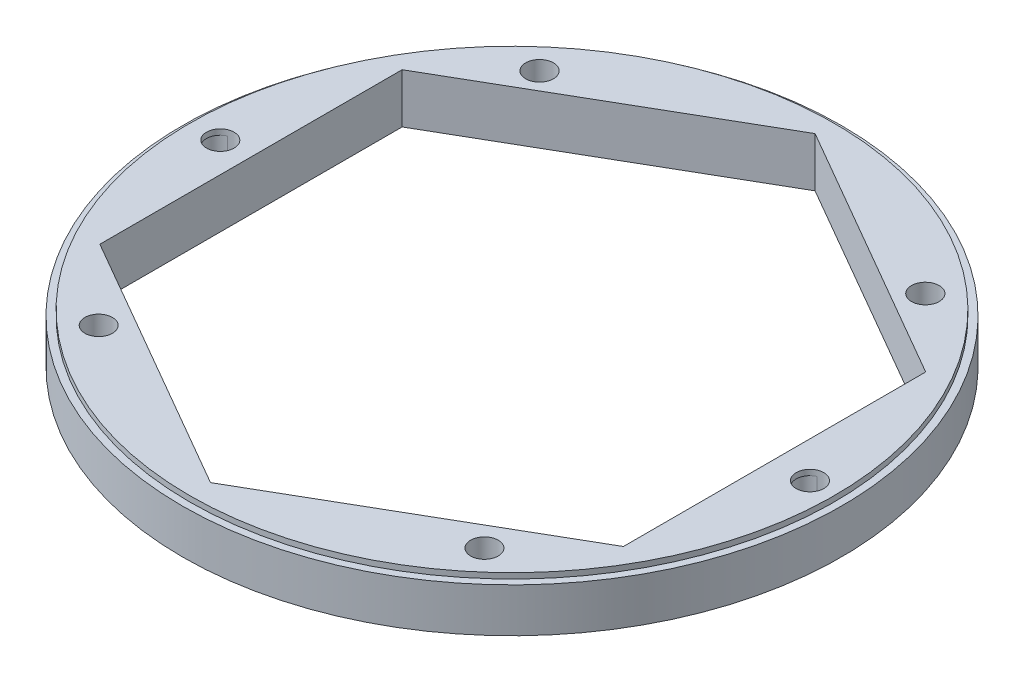
ISO-10303-21;
HEADER;
FILE_DESCRIPTION(('STEP AP214'),'2;1');
FILE_NAME('part.step','',(''),(''),'','','');
FILE_SCHEMA(('AUTOMOTIVE_DESIGN { 1 0 10303 214 1 1 1 1 }'));
ENDSEC;
DATA;
#1=APPLICATION_CONTEXT('core data for automotive mechanical design processes');
#2=APPLICATION_PROTOCOL_DEFINITION('international standard','automotive_design',2000,#1);
#3=PRODUCT_CONTEXT('',#1,'mechanical');
#4=PRODUCT('Part','Part','',(#3));
#5=PRODUCT_RELATED_PRODUCT_CATEGORY('part','',(#4));
#6=PRODUCT_DEFINITION_FORMATION('','',#4);
#7=PRODUCT_DEFINITION_CONTEXT('part definition',#1,'design');
#8=PRODUCT_DEFINITION('design','',#6,#7);
#9=PRODUCT_DEFINITION_SHAPE('','',#8);
#10=(LENGTH_UNIT() NAMED_UNIT(*) SI_UNIT(.MILLI.,.METRE.));
#11=(NAMED_UNIT(*) PLANE_ANGLE_UNIT() SI_UNIT($,.RADIAN.));
#12=(NAMED_UNIT(*) SI_UNIT($,.STERADIAN.) SOLID_ANGLE_UNIT());
#13=UNCERTAINTY_MEASURE_WITH_UNIT(LENGTH_MEASURE(1.E-05),#10,'distance_accuracy_value','');
#14=(GEOMETRIC_REPRESENTATION_CONTEXT(3) GLOBAL_UNCERTAINTY_ASSIGNED_CONTEXT((#13)) GLOBAL_UNIT_ASSIGNED_CONTEXT((#10,
#11,#12)) REPRESENTATION_CONTEXT('',''));
#15=CARTESIAN_POINT('',(0.,0.,0.));
#16=DIRECTION('',(0.,0.,1.));
#17=DIRECTION('',(1.,0.,0.));
#18=AXIS2_PLACEMENT_3D('',#15,#16,#17);
#19=CARTESIAN_POINT('',(0.,10.16,0.));
#20=DIRECTION('',(0.,-1.,0.));
#21=DIRECTION('',(0.,0.,-1.));
#22=AXIS2_PLACEMENT_3D('',#19,#20,#21);
#23=CYLINDRICAL_SURFACE('',#22,75.946);
#24=CARTESIAN_POINT('',(0.,10.16,0.));
#25=DIRECTION('',(0.,1.,0.));
#26=DIRECTION('',(0.,0.,1.));
#27=AXIS2_PLACEMENT_3D('',#24,#25,#26);
#28=CIRCLE('',#27,75.946);
#29=CARTESIAN_POINT('',(0.,10.16,75.946));
#30=VERTEX_POINT('',#29);
#31=EDGE_CURVE('E263',#30,#30,#28,.T.);
#32=ORIENTED_EDGE('',*,*,#31,.F.);
#33=EDGE_LOOP('',(#32));
#34=FACE_BOUND('',#33,.T.);
#35=CARTESIAN_POINT('',(0.,0.,0.));
#36=DIRECTION('',(0.,1.,0.));
#37=DIRECTION('',(0.,0.,1.));
#38=AXIS2_PLACEMENT_3D('',#35,#36,#37);
#39=CIRCLE('',#38,75.946);
#40=CARTESIAN_POINT('',(0.,0.,75.946));
#41=VERTEX_POINT('',#40);
#42=EDGE_CURVE('E330',#41,#41,#39,.T.);
#43=ORIENTED_EDGE('',*,*,#42,.T.);
#44=EDGE_LOOP('',(#43));
#45=FACE_BOUND('',#44,.T.);
#46=ADVANCED_FACE('F39',(#34,#45),#23,.T.);
#47=CARTESIAN_POINT('',(0.,10.16,0.));
#48=DIRECTION('',(0.,1.,0.));
#49=DIRECTION('',(0.,0.,1.));
#50=AXIS2_PLACEMENT_3D('',#47,#48,#49);
#51=PLANE('',#50);
#52=CARTESIAN_POINT('',(0.,10.16,0.));
#53=DIRECTION('',(0.,1.,0.));
#54=DIRECTION('',(0.,0.,1.));
#55=AXIS2_PLACEMENT_3D('',#52,#53,#54);
#56=CIRCLE('',#55,74.295);
#57=CARTESIAN_POINT('',(0.,10.16,74.295));
#58=VERTEX_POINT('',#57);
#59=EDGE_CURVE('E259',#58,#58,#56,.T.);
#60=ORIENTED_EDGE('',*,*,#59,.F.);
#61=EDGE_LOOP('',(#60));
#62=FACE_BOUND('',#61,.T.);
#63=ORIENTED_EDGE('',*,*,#31,.T.);
#64=EDGE_LOOP('',(#63));
#65=FACE_BOUND('',#64,.T.);
#66=ADVANCED_FACE('F410',(#62,#65),#51,.T.);
#67=CARTESIAN_POINT('',(0.,0.,0.));
#68=DIRECTION('',(0.,1.,0.));
#69=DIRECTION('',(0.,0.,1.));
#70=AXIS2_PLACEMENT_3D('',#67,#68,#69);
#71=PLANE('',#70);
#72=DIRECTION('',(-0.866025403784439,0.,-0.5));
#73=VECTOR('',#72,1.);
#74=CARTESIAN_POINT('',(60.325,0.,-34.8286549888642));
#75=LINE('',#74,#73);
#76=CARTESIAN_POINT('',(60.325,0.,-34.8286549888642));
#77=VERTEX_POINT('',#76);
#78=CARTESIAN_POINT('',(60.1441525682417,0.,-34.9330673022721));
#79=VERTEX_POINT('',#78);
#80=EDGE_CURVE('E300',#77,#79,#75,.T.);
#81=ORIENTED_EDGE('',*,*,#80,.T.);
#82=DIRECTION('',(0.,0.,-1.));
#83=VECTOR('',#82,1.);
#84=CARTESIAN_POINT('',(60.1441525682418,0.,34.4669601253477));
#85=LINE('',#84,#83);
#86=CARTESIAN_POINT('',(60.1441525682417,0.,-35.1903498523806));
#87=VERTEX_POINT('',#86);
#88=EDGE_CURVE('E159',#79,#87,#85,.T.);
#89=ORIENTED_EDGE('',*,*,#88,.T.);
#90=DIRECTION('',(-0.866025403784439,0.,-0.5));
#91=VECTOR('',#90,1.);
#92=CARTESIAN_POINT('',(60.1441525682417,0.,-35.1903498523806));
#93=LINE('',#92,#91);
#94=CARTESIAN_POINT('',(-0.180847431758238,0.,-70.0190048412448));
#95=VERTEX_POINT('',#94);
#96=EDGE_CURVE('E153',#87,#95,#93,.T.);
#97=ORIENTED_EDGE('',*,*,#96,.T.);
#98=DIRECTION('',(-0.866025403784439,0.,0.5));
#99=VECTOR('',#98,1.);
#100=CARTESIAN_POINT('',(-0.180847431758238,0.,-70.0190048412448));
#101=LINE('',#100,#99);
#102=CARTESIAN_POINT('',(-60.5058474317582,0.,-35.1903498523806));
#103=VERTEX_POINT('',#102);
#104=EDGE_CURVE('E162',#95,#103,#101,.T.);
#105=ORIENTED_EDGE('',*,*,#104,.T.);
#106=DIRECTION('',(0.,0.,1.));
#107=VECTOR('',#106,1.);
#108=CARTESIAN_POINT('',(-60.5058474317582,0.,-35.1903498523806));
#109=LINE('',#108,#107);
#110=CARTESIAN_POINT('',(-60.5058474317582,0.,34.4669601253478));
#111=VERTEX_POINT('',#110);
#112=EDGE_CURVE('E167',#103,#111,#109,.T.);
#113=ORIENTED_EDGE('',*,*,#112,.T.);
#114=DIRECTION('',(0.866025403784438,0.,0.5));
#115=VECTOR('',#114,1.);
#116=CARTESIAN_POINT('',(-60.5058474317582,0.,34.4669601253478));
#117=LINE('',#116,#115);
#118=CARTESIAN_POINT('',(-60.325,0.,34.5713724387556));
#119=VERTEX_POINT('',#118);
#120=EDGE_CURVE('E179',#111,#119,#117,.T.);
#121=ORIENTED_EDGE('',*,*,#120,.T.);
#122=DIRECTION('',(0.,0.,1.));
#123=VECTOR('',#122,1.);
#124=CARTESIAN_POINT('',(-60.325,0.,-34.8286549888642));
#125=LINE('',#124,#123);
#126=CARTESIAN_POINT('',(-60.325,0.,34.8286549888642));
#127=VERTEX_POINT('',#126);
#128=EDGE_CURVE('E302',#119,#127,#125,.T.);
#129=ORIENTED_EDGE('',*,*,#128,.T.);
#130=DIRECTION('',(0.866025403784439,0.,0.5));
#131=VECTOR('',#130,1.);
#132=CARTESIAN_POINT('',(-60.325,0.,34.8286549888642));
#133=LINE('',#132,#131);
#134=CARTESIAN_POINT('',(0.,0.,69.6573099777283));
#135=VERTEX_POINT('',#134);
#136=EDGE_CURVE('E305',#127,#135,#133,.T.);
#137=ORIENTED_EDGE('',*,*,#136,.T.);
#138=DIRECTION('',(0.866025403784439,0.,-0.5));
#139=VECTOR('',#138,1.);
#140=CARTESIAN_POINT('',(0.,0.,69.6573099777283));
#141=LINE('',#140,#139);
#142=CARTESIAN_POINT('',(60.325,0.,34.8286549888642));
#143=VERTEX_POINT('',#142);
#144=EDGE_CURVE('E308',#135,#143,#141,.T.);
#145=ORIENTED_EDGE('',*,*,#144,.T.);
#146=DIRECTION('',(0.,0.,-1.));
#147=VECTOR('',#146,1.);
#148=CARTESIAN_POINT('',(60.325,0.,34.8286549888642));
#149=LINE('',#148,#147);
#150=EDGE_CURVE('E311',#143,#77,#149,.T.);
#151=ORIENTED_EDGE('',*,*,#150,.T.);
#152=EDGE_LOOP('',(#81,#89,#97,#105,#113,#121,#129,#137,#145,#151));
#153=FACE_BOUND('',#152,.T.);
#154=CARTESIAN_POINT('',(44.45,0.,-50.8));
#155=DIRECTION('',(0.,1.,0.));
#156=DIRECTION('',(0.,0.,-1.));
#157=AXIS2_PLACEMENT_3D('',#154,#155,#156);
#158=CIRCLE('',#157,3.2);
#159=CARTESIAN_POINT('',(44.45,0.,-54.));
#160=VERTEX_POINT('',#159);
#161=EDGE_CURVE('E207',#160,#160,#158,.T.);
#162=ORIENTED_EDGE('',*,*,#161,.T.);
#163=EDGE_LOOP('',(#162));
#164=FACE_BOUND('',#163,.T.);
#165=CARTESIAN_POINT('',(44.45,0.,50.8));
#166=DIRECTION('',(0.,1.,0.));
#167=DIRECTION('',(0.,0.,-1.));
#168=AXIS2_PLACEMENT_3D('',#165,#166,#167);
#169=CIRCLE('',#168,3.175);
#170=CARTESIAN_POINT('',(44.45,0.,47.625));
#171=VERTEX_POINT('',#170);
#172=EDGE_CURVE('E236',#171,#171,#169,.T.);
#173=ORIENTED_EDGE('',*,*,#172,.T.);
#174=EDGE_LOOP('',(#173));
#175=FACE_BOUND('',#174,.T.);
#176=CARTESIAN_POINT('',(-44.45,0.,50.8));
#177=DIRECTION('',(0.,1.,0.));
#178=DIRECTION('',(0.,0.,1.));
#179=AXIS2_PLACEMENT_3D('',#176,#177,#178);
#180=CIRCLE('',#179,3.175);
#181=CARTESIAN_POINT('',(-44.45,0.,53.975));
#182=VERTEX_POINT('',#181);
#183=EDGE_CURVE('E230',#182,#182,#180,.T.);
#184=ORIENTED_EDGE('',*,*,#183,.T.);
#185=EDGE_LOOP('',(#184));
#186=FACE_BOUND('',#185,.T.);
#187=CARTESIAN_POINT('',(-44.45,0.,-50.8));
#188=DIRECTION('',(0.,1.,0.));
#189=DIRECTION('',(0.,0.,1.));
#190=AXIS2_PLACEMENT_3D('',#187,#188,#189);
#191=CIRCLE('',#190,3.2);
#192=CARTESIAN_POINT('',(-44.45,0.,-47.6));
#193=VERTEX_POINT('',#192);
#194=EDGE_CURVE('E224',#193,#193,#191,.T.);
#195=ORIENTED_EDGE('',*,*,#194,.T.);
#196=EDGE_LOOP('',(#195));
#197=FACE_BOUND('',#196,.T.);
#198=CARTESIAN_POINT('',(-67.945,0.,0.));
#199=DIRECTION('',(0.,1.,0.));
#200=DIRECTION('',(0.,0.,1.));
#201=AXIS2_PLACEMENT_3D('',#198,#199,#200);
#202=CIRCLE('',#201,3.18347823414576);
#203=CARTESIAN_POINT('',(-68.6763638399502,0.,-3.09832867864162));
#204=VERTEX_POINT('',#203);
#205=CARTESIAN_POINT('',(-66.6710938647752,0.,2.91748124688341));
#206=VERTEX_POINT('',#205);
#207=EDGE_CURVE('E264',#204,#206,#202,.T.);
#208=ORIENTED_EDGE('',*,*,#207,.T.);
#209=CARTESIAN_POINT('',(-67.4024577047254,0.,-0.18084743175821));
#210=DIRECTION('',(0.,1.,0.));
#211=DIRECTION('',(0.,0.,1.));
#212=AXIS2_PLACEMENT_3D('',#209,#210,#211);
#213=CIRCLE('',#212,3.18347823414576);
#214=EDGE_CURVE('E208',#206,#204,#213,.T.);
#215=ORIENTED_EDGE('',*,*,#214,.T.);
#216=EDGE_LOOP('',(#208,#215));
#217=FACE_BOUND('',#216,.T.);
#218=CARTESIAN_POINT('',(33.7795726028679,0.,-58.8088547950906));
#219=DIRECTION('',(0.,1.,0.));
#220=DIRECTION('',(0.,0.,-1.));
#221=AXIS2_PLACEMENT_3D('',#218,#219,#220);
#222=CIRCLE('',#221,3.2);
#223=CARTESIAN_POINT('',(33.7795726028679,0.,-62.0088547950906));
#224=VERTEX_POINT('',#223);
#225=EDGE_CURVE('E269',#224,#224,#222,.T.);
#226=ORIENTED_EDGE('',*,*,#225,.T.);
#227=EDGE_LOOP('',(#226));
#228=FACE_BOUND('',#227,.T.);
#229=CARTESIAN_POINT('',(67.945,0.,0.));
#230=DIRECTION('',(0.,1.,0.));
#231=DIRECTION('',(0.,0.,-1.));
#232=AXIS2_PLACEMENT_3D('',#229,#230,#231);
#233=CIRCLE('',#232,3.18347823414576);
#234=CARTESIAN_POINT('',(67.2136361600498,0.,-3.09832867864162));
#235=VERTEX_POINT('',#234);
#236=CARTESIAN_POINT('',(69.2189061352248,0.,2.91748124688341));
#237=VERTEX_POINT('',#236);
#238=EDGE_CURVE('E272',#235,#237,#233,.T.);
#239=ORIENTED_EDGE('',*,*,#238,.T.);
#240=CARTESIAN_POINT('',(68.4875422952747,0.,-0.18084743175821));
#241=DIRECTION('',(0.,1.,0.));
#242=DIRECTION('',(0.,0.,-1.));
#243=AXIS2_PLACEMENT_3D('',#240,#241,#242);
#244=CIRCLE('',#243,3.18347823414576);
#245=EDGE_CURVE('E219',#237,#235,#244,.T.);
#246=ORIENTED_EDGE('',*,*,#245,.T.);
#247=EDGE_LOOP('',(#239,#246));
#248=FACE_BOUND('',#247,.T.);
#249=CARTESIAN_POINT('',(33.9533081466792,0.,58.8088547950906));
#250=DIRECTION('',(0.,1.,0.));
#251=DIRECTION('',(0.,0.,-1.));
#252=AXIS2_PLACEMENT_3D('',#249,#250,#251);
#253=CIRCLE('',#252,3.175);
#254=CARTESIAN_POINT('',(33.9533081466792,0.,55.6338547950906));
#255=VERTEX_POINT('',#254);
#256=EDGE_CURVE('E279',#255,#255,#253,.T.);
#257=ORIENTED_EDGE('',*,*,#256,.T.);
#258=EDGE_LOOP('',(#257));
#259=FACE_BOUND('',#258,.T.);
#260=CARTESIAN_POINT('',(-33.9533081466792,0.,58.8088547950906));
#261=DIRECTION('',(0.,1.,0.));
#262=DIRECTION('',(0.,0.,1.));
#263=AXIS2_PLACEMENT_3D('',#260,#261,#262);
#264=CIRCLE('',#263,3.175);
#265=CARTESIAN_POINT('',(-33.9533081466792,0.,61.9838547950906));
#266=VERTEX_POINT('',#265);
#267=EDGE_CURVE('E276',#266,#266,#264,.T.);
#268=ORIENTED_EDGE('',*,*,#267,.T.);
#269=EDGE_LOOP('',(#268));
#270=FACE_BOUND('',#269,.T.);
#271=CARTESIAN_POINT('',(-33.7795726028679,0.,-58.8088547950906));
#272=DIRECTION('',(0.,1.,0.));
#273=DIRECTION('',(0.,0.,1.));
#274=AXIS2_PLACEMENT_3D('',#271,#272,#273);
#275=CIRCLE('',#274,3.2);
#276=CARTESIAN_POINT('',(-33.7795726028679,0.,-55.6088547950906));
#277=VERTEX_POINT('',#276);
#278=EDGE_CURVE('E268',#277,#277,#275,.T.);
#279=ORIENTED_EDGE('',*,*,#278,.T.);
#280=EDGE_LOOP('',(#279));
#281=FACE_BOUND('',#280,.T.);
#282=ORIENTED_EDGE('',*,*,#42,.F.);
#283=EDGE_LOOP('',(#282));
#284=FACE_BOUND('',#283,.T.);
#285=ADVANCED_FACE('F170',(#153,#164,#175,#186,#197,#217,#228,#248,#259,#270,#281,#284),#71,.F.);
#286=CARTESIAN_POINT('',(60.325,0.,-34.8286549888642));
#287=DIRECTION('',(0.5,0.,-0.866025403784439));
#288=DIRECTION('',(-0.866025403784439,0.,-0.5));
#289=AXIS2_PLACEMENT_3D('',#286,#287,#288);
#290=PLANE('',#289);
#291=DIRECTION('',(-0.866025403784439,0.,-0.5));
#292=VECTOR('',#291,1.);
#293=CARTESIAN_POINT('',(60.325,10.16,-34.8286549888642));
#294=LINE('',#293,#292);
#295=CARTESIAN_POINT('',(60.325,10.16,-34.8286549888642));
#296=VERTEX_POINT('',#295);
#297=CARTESIAN_POINT('',(60.1441525682417,10.16,-34.9330673022721));
#298=VERTEX_POINT('',#297);
#299=EDGE_CURVE('E267',#296,#298,#294,.T.);
#300=ORIENTED_EDGE('',*,*,#299,.T.);
#301=DIRECTION('',(0.,-1.,0.));
#302=VECTOR('',#301,1.);
#303=CARTESIAN_POINT('',(60.1441525682417,0.,-34.9330673022721));
#304=LINE('',#303,#302);
#305=EDGE_CURVE('E204',#298,#79,#304,.T.);
#306=ORIENTED_EDGE('',*,*,#305,.T.);
#307=ORIENTED_EDGE('',*,*,#80,.F.);
#308=DIRECTION('',(0.,1.,0.));
#309=VECTOR('',#308,1.);
#310=CARTESIAN_POINT('',(60.325,0.,-34.8286549888642));
#311=LINE('',#310,#309);
#312=EDGE_CURVE('E327',#77,#296,#311,.T.);
#313=ORIENTED_EDGE('',*,*,#312,.T.);
#314=EDGE_LOOP('',(#300,#306,#307,#313));
#315=FACE_BOUND('',#314,.T.);
#316=ADVANCED_FACE('F363',(#315),#290,.F.);
#317=CARTESIAN_POINT('',(60.325,0.,34.8286549888642));
#318=DIRECTION('',(1.,0.,0.));
#319=DIRECTION('',(0.,0.,-1.));
#320=AXIS2_PLACEMENT_3D('',#317,#318,#319);
#321=PLANE('',#320);
#322=DIRECTION('',(0.,0.,-1.));
#323=VECTOR('',#322,1.);
#324=CARTESIAN_POINT('',(60.325,10.16,34.8286549888642));
#325=LINE('',#324,#323);
#326=CARTESIAN_POINT('',(60.325,10.16,34.8286549888642));
#327=VERTEX_POINT('',#326);
#328=EDGE_CURVE('E303',#327,#296,#325,.T.);
#329=ORIENTED_EDGE('',*,*,#328,.T.);
#330=ORIENTED_EDGE('',*,*,#312,.F.);
#331=ORIENTED_EDGE('',*,*,#150,.F.);
#332=DIRECTION('',(0.,1.,0.));
#333=VECTOR('',#332,1.);
#334=CARTESIAN_POINT('',(60.325,0.,34.8286549888642));
#335=LINE('',#334,#333);
#336=EDGE_CURVE('E331',#143,#327,#335,.T.);
#337=ORIENTED_EDGE('',*,*,#336,.T.);
#338=EDGE_LOOP('',(#329,#330,#331,#337));
#339=FACE_BOUND('',#338,.T.);
#340=ADVANCED_FACE('F367',(#339),#321,.F.);
#341=CARTESIAN_POINT('',(0.,0.,69.6573099777283));
#342=DIRECTION('',(0.5,0.,0.866025403784439));
#343=DIRECTION('',(0.866025403784439,0.,-0.5));
#344=AXIS2_PLACEMENT_3D('',#341,#342,#343);
#345=PLANE('',#344);
#346=DIRECTION('',(0.866025403784439,0.,-0.5));
#347=VECTOR('',#346,1.);
#348=CARTESIAN_POINT('',(0.,10.16,69.6573099777283));
#349=LINE('',#348,#347);
#350=CARTESIAN_POINT('',(0.,10.16,69.6573099777283));
#351=VERTEX_POINT('',#350);
#352=EDGE_CURVE('E322',#351,#327,#349,.T.);
#353=ORIENTED_EDGE('',*,*,#352,.T.);
#354=ORIENTED_EDGE('',*,*,#336,.F.);
#355=ORIENTED_EDGE('',*,*,#144,.F.);
#356=DIRECTION('',(0.,1.,0.));
#357=VECTOR('',#356,1.);
#358=CARTESIAN_POINT('',(0.,0.,69.6573099777283));
#359=LINE('',#358,#357);
#360=EDGE_CURVE('E334',#135,#351,#359,.T.);
#361=ORIENTED_EDGE('',*,*,#360,.T.);
#362=EDGE_LOOP('',(#353,#354,#355,#361));
#363=FACE_BOUND('',#362,.T.);
#364=ADVANCED_FACE('F370',(#363),#345,.F.);
#365=CARTESIAN_POINT('',(-60.325,0.,34.8286549888642));
#366=DIRECTION('',(-0.5,0.,0.866025403784439));
#367=DIRECTION('',(0.866025403784439,0.,0.5));
#368=AXIS2_PLACEMENT_3D('',#365,#366,#367);
#369=PLANE('',#368);
#370=DIRECTION('',(0.866025403784439,0.,0.5));
#371=VECTOR('',#370,1.);
#372=CARTESIAN_POINT('',(-60.325,10.16,34.8286549888642));
#373=LINE('',#372,#371);
#374=CARTESIAN_POINT('',(-60.325,10.16,34.8286549888642));
#375=VERTEX_POINT('',#374);
#376=EDGE_CURVE('E319',#375,#351,#373,.T.);
#377=ORIENTED_EDGE('',*,*,#376,.T.);
#378=ORIENTED_EDGE('',*,*,#360,.F.);
#379=ORIENTED_EDGE('',*,*,#136,.F.);
#380=DIRECTION('',(0.,1.,0.));
#381=VECTOR('',#380,1.);
#382=CARTESIAN_POINT('',(-60.325,0.,34.8286549888642));
#383=LINE('',#382,#381);
#384=EDGE_CURVE('E314',#127,#375,#383,.T.);
#385=ORIENTED_EDGE('',*,*,#384,.T.);
#386=EDGE_LOOP('',(#377,#378,#379,#385));
#387=FACE_BOUND('',#386,.T.);
#388=ADVANCED_FACE('F373',(#387),#369,.F.);
#389=CARTESIAN_POINT('',(-60.325,0.,-34.8286549888642));
#390=DIRECTION('',(-1.,0.,0.));
#391=DIRECTION('',(0.,0.,1.));
#392=AXIS2_PLACEMENT_3D('',#389,#390,#391);
#393=PLANE('',#392);
#394=ORIENTED_EDGE('',*,*,#128,.F.);
#395=DIRECTION('',(0.,1.,0.));
#396=VECTOR('',#395,1.);
#397=CARTESIAN_POINT('',(-60.325,0.,34.5713724387556));
#398=LINE('',#397,#396);
#399=CARTESIAN_POINT('',(-60.325,10.16,34.5713724387556));
#400=VERTEX_POINT('',#399);
#401=EDGE_CURVE('E195',#119,#400,#398,.T.);
#402=ORIENTED_EDGE('',*,*,#401,.T.);
#403=DIRECTION('',(0.,0.,1.));
#404=VECTOR('',#403,1.);
#405=CARTESIAN_POINT('',(-60.325,10.16,-34.8286549888642));
#406=LINE('',#405,#404);
#407=EDGE_CURVE('E317',#400,#375,#406,.T.);
#408=ORIENTED_EDGE('',*,*,#407,.T.);
#409=ORIENTED_EDGE('',*,*,#384,.F.);
#410=EDGE_LOOP('',(#394,#402,#408,#409));
#411=FACE_BOUND('',#410,.T.);
#412=ADVANCED_FACE('F377',(#411),#393,.F.);
#413=CARTESIAN_POINT('',(-33.7795726028679,0.,-58.8088547950906));
#414=DIRECTION('',(0.,1.,0.));
#415=DIRECTION('',(0.,0.,1.));
#416=AXIS2_PLACEMENT_3D('',#413,#414,#415);
#417=CYLINDRICAL_SURFACE('',#416,3.2);
#418=CARTESIAN_POINT('',(-33.7795726028679,10.16,-58.8088547950906));
#419=DIRECTION('',(0.,1.,0.));
#420=DIRECTION('',(0.,0.,1.));
#421=AXIS2_PLACEMENT_3D('',#418,#419,#420);
#422=CIRCLE('',#421,3.2);
#423=CARTESIAN_POINT('',(-33.7795726028679,10.16,-55.6088547950906));
#424=VERTEX_POINT('',#423);
#425=EDGE_CURVE('E258',#424,#424,#422,.T.);
#426=ORIENTED_EDGE('',*,*,#425,.T.);
#427=EDGE_LOOP('',(#426));
#428=FACE_BOUND('',#427,.T.);
#429=ORIENTED_EDGE('',*,*,#278,.F.);
#430=EDGE_LOOP('',(#429));
#431=FACE_BOUND('',#430,.T.);
#432=ADVANCED_FACE('F429',(#428,#431),#417,.F.);
#433=CARTESIAN_POINT('',(-33.9533081466792,0.,58.8088547950906));
#434=DIRECTION('',(0.,1.,0.));
#435=DIRECTION('',(0.,0.,1.));
#436=AXIS2_PLACEMENT_3D('',#433,#434,#435);
#437=CYLINDRICAL_SURFACE('',#436,3.175);
#438=CARTESIAN_POINT('',(-33.9533081466792,10.16,58.8088547950906));
#439=DIRECTION('',(0.,1.,0.));
#440=DIRECTION('',(0.,0.,1.));
#441=AXIS2_PLACEMENT_3D('',#438,#439,#440);
#442=CIRCLE('',#441,3.175);
#443=CARTESIAN_POINT('',(-33.9533081466792,10.16,61.9838547950906));
#444=VERTEX_POINT('',#443);
#445=EDGE_CURVE('E286',#444,#444,#442,.T.);
#446=ORIENTED_EDGE('',*,*,#445,.T.);
#447=EDGE_LOOP('',(#446));
#448=FACE_BOUND('',#447,.T.);
#449=ORIENTED_EDGE('',*,*,#267,.F.);
#450=EDGE_LOOP('',(#449));
#451=FACE_BOUND('',#450,.T.);
#452=ADVANCED_FACE('F444',(#448,#451),#437,.F.);
#453=CARTESIAN_POINT('',(33.9533081466792,0.,58.8088547950906));
#454=DIRECTION('',(0.,1.,0.));
#455=DIRECTION('',(0.,0.,1.));
#456=AXIS2_PLACEMENT_3D('',#453,#454,#455);
#457=CYLINDRICAL_SURFACE('',#456,3.175);
#458=CARTESIAN_POINT('',(33.9533081466792,10.16,58.8088547950906));
#459=DIRECTION('',(0.,1.,0.));
#460=DIRECTION('',(0.,0.,1.));
#461=AXIS2_PLACEMENT_3D('',#458,#459,#460);
#462=CIRCLE('',#461,3.175);
#463=CARTESIAN_POINT('',(33.9533081466792,10.16,61.9838547950906));
#464=VERTEX_POINT('',#463);
#465=EDGE_CURVE('E289',#464,#464,#462,.T.);
#466=ORIENTED_EDGE('',*,*,#465,.T.);
#467=EDGE_LOOP('',(#466));
#468=FACE_BOUND('',#467,.T.);
#469=ORIENTED_EDGE('',*,*,#256,.F.);
#470=EDGE_LOOP('',(#469));
#471=FACE_BOUND('',#470,.T.);
#472=ADVANCED_FACE('F440',(#468,#471),#457,.F.);
#473=CARTESIAN_POINT('',(67.945,0.,0.));
#474=DIRECTION('',(0.,1.,0.));
#475=DIRECTION('',(0.,0.,1.));
#476=AXIS2_PLACEMENT_3D('',#473,#474,#475);
#477=CYLINDRICAL_SURFACE('',#476,3.18347823414576);
#478=ORIENTED_EDGE('',*,*,#238,.F.);
#479=DIRECTION('',(0.,1.,0.));
#480=VECTOR('',#479,1.);
#481=CARTESIAN_POINT('',(67.2136361600498,5.715,-3.09832867864162));
#482=LINE('',#481,#480);
#483=CARTESIAN_POINT('',(67.2136361600498,10.16,-3.09832867864162));
#484=VERTEX_POINT('',#483);
#485=EDGE_CURVE('E252',#235,#484,#482,.T.);
#486=ORIENTED_EDGE('',*,*,#485,.T.);
#487=CARTESIAN_POINT('',(67.945,10.16,0.));
#488=DIRECTION('',(0.,1.,0.));
#489=DIRECTION('',(0.,0.,1.));
#490=AXIS2_PLACEMENT_3D('',#487,#488,#489);
#491=CIRCLE('',#490,3.18347823414576);
#492=CARTESIAN_POINT('',(69.2189061352248,10.16,2.91748124688341));
#493=VERTEX_POINT('',#492);
#494=EDGE_CURVE('E292',#484,#493,#491,.T.);
#495=ORIENTED_EDGE('',*,*,#494,.T.);
#496=DIRECTION('',(0.,1.,0.));
#497=VECTOR('',#496,1.);
#498=CARTESIAN_POINT('',(69.2189061352248,5.715,2.91748124688341));
#499=LINE('',#498,#497);
#500=EDGE_CURVE('E249',#493,#237,#499,.F.);
#501=ORIENTED_EDGE('',*,*,#500,.T.);
#502=EDGE_LOOP('',(#478,#486,#495,#501));
#503=FACE_BOUND('',#502,.T.);
#504=ADVANCED_FACE('F436',(#503),#477,.F.);
#505=CARTESIAN_POINT('',(33.7795726028679,0.,-58.8088547950906));
#506=DIRECTION('',(0.,1.,0.));
#507=DIRECTION('',(0.,0.,1.));
#508=AXIS2_PLACEMENT_3D('',#505,#506,#507);
#509=CYLINDRICAL_SURFACE('',#508,3.2);
#510=CARTESIAN_POINT('',(33.7795726028679,10.16,-58.8088547950906));
#511=DIRECTION('',(0.,1.,0.));
#512=DIRECTION('',(0.,0.,1.));
#513=AXIS2_PLACEMENT_3D('',#510,#511,#512);
#514=CIRCLE('',#513,3.2);
#515=CARTESIAN_POINT('',(33.7795726028679,10.16,-55.6088547950906));
#516=VERTEX_POINT('',#515);
#517=EDGE_CURVE('E295',#516,#516,#514,.T.);
#518=ORIENTED_EDGE('',*,*,#517,.T.);
#519=EDGE_LOOP('',(#518));
#520=FACE_BOUND('',#519,.T.);
#521=ORIENTED_EDGE('',*,*,#225,.F.);
#522=EDGE_LOOP('',(#521));
#523=FACE_BOUND('',#522,.T.);
#524=ADVANCED_FACE('F439',(#520,#523),#509,.F.);
#525=CARTESIAN_POINT('',(-67.945,0.,0.));
#526=DIRECTION('',(0.,1.,0.));
#527=DIRECTION('',(0.,0.,1.));
#528=AXIS2_PLACEMENT_3D('',#525,#526,#527);
#529=CYLINDRICAL_SURFACE('',#528,3.18347823414576);
#530=ORIENTED_EDGE('',*,*,#207,.F.);
#531=DIRECTION('',(0.,1.,0.));
#532=VECTOR('',#531,1.);
#533=CARTESIAN_POINT('',(-68.6763638399502,5.715,-3.09832867864162));
#534=LINE('',#533,#532);
#535=CARTESIAN_POINT('',(-68.6763638399502,10.16,-3.09832867864162));
#536=VERTEX_POINT('',#535);
#537=EDGE_CURVE('E246',#204,#536,#534,.T.);
#538=ORIENTED_EDGE('',*,*,#537,.T.);
#539=CARTESIAN_POINT('',(-67.945,10.16,0.));
#540=DIRECTION('',(0.,1.,0.));
#541=DIRECTION('',(0.,0.,1.));
#542=AXIS2_PLACEMENT_3D('',#539,#540,#541);
#543=CIRCLE('',#542,3.18347823414576);
#544=CARTESIAN_POINT('',(-66.6710938647752,10.16,2.91748124688341));
#545=VERTEX_POINT('',#544);
#546=EDGE_CURVE('E273',#536,#545,#543,.T.);
#547=ORIENTED_EDGE('',*,*,#546,.T.);
#548=DIRECTION('',(0.,1.,0.));
#549=VECTOR('',#548,1.);
#550=CARTESIAN_POINT('',(-66.6710938647752,5.715,2.91748124688341));
#551=LINE('',#550,#549);
#552=EDGE_CURVE('E211',#545,#206,#551,.F.);
#553=ORIENTED_EDGE('',*,*,#552,.T.);
#554=EDGE_LOOP('',(#530,#538,#547,#553));
#555=FACE_BOUND('',#554,.T.);
#556=ADVANCED_FACE('F389',(#555),#529,.F.);
#557=CARTESIAN_POINT('',(0.,11.43,0.));
#558=DIRECTION('',(0.,1.,0.));
#559=DIRECTION('',(0.,0.,1.));
#560=AXIS2_PLACEMENT_3D('',#557,#558,#559);
#561=PLANE('',#560);
#562=DIRECTION('',(-0.866025403784439,0.,-0.5));
#563=VECTOR('',#562,1.);
#564=CARTESIAN_POINT('',(60.1441525682417,11.43,-35.1903498523806));
#565=LINE('',#564,#563);
#566=CARTESIAN_POINT('',(60.1441525682417,11.43,-35.1903498523806));
#567=VERTEX_POINT('',#566);
#568=CARTESIAN_POINT('',(-0.180847431758238,11.43,-70.0190048412448));
#569=VERTEX_POINT('',#568);
#570=EDGE_CURVE('E53',#567,#569,#565,.T.);
#571=ORIENTED_EDGE('',*,*,#570,.F.);
#572=DIRECTION('',(0.,0.,-1.));
#573=VECTOR('',#572,1.);
#574=CARTESIAN_POINT('',(60.1441525682418,11.43,34.4669601253477));
#575=LINE('',#574,#573);
#576=CARTESIAN_POINT('',(60.1441525682418,11.43,34.4669601253477));
#577=VERTEX_POINT('',#576);
#578=EDGE_CURVE('E172',#577,#567,#575,.T.);
#579=ORIENTED_EDGE('',*,*,#578,.F.);
#580=DIRECTION('',(0.866025403784439,0.,-0.5));
#581=VECTOR('',#580,1.);
#582=CARTESIAN_POINT('',(-0.180847431758228,11.43,69.2956151142119));
#583=LINE('',#582,#581);
#584=CARTESIAN_POINT('',(-0.180847431758228,11.43,69.2956151142119));
#585=VERTEX_POINT('',#584);
#586=EDGE_CURVE('E175',#585,#577,#583,.T.);
#587=ORIENTED_EDGE('',*,*,#586,.F.);
#588=DIRECTION('',(0.866025403784438,0.,0.5));
#589=VECTOR('',#588,1.);
#590=CARTESIAN_POINT('',(-60.5058474317582,11.43,34.4669601253478));
#591=LINE('',#590,#589);
#592=CARTESIAN_POINT('',(-60.5058474317582,11.43,34.4669601253478));
#593=VERTEX_POINT('',#592);
#594=EDGE_CURVE('E189',#593,#585,#591,.T.);
#595=ORIENTED_EDGE('',*,*,#594,.F.);
#596=DIRECTION('',(0.,0.,1.));
#597=VECTOR('',#596,1.);
#598=CARTESIAN_POINT('',(-60.5058474317582,11.43,-35.1903498523806));
#599=LINE('',#598,#597);
#600=CARTESIAN_POINT('',(-60.5058474317582,11.43,-35.1903498523806));
#601=VERTEX_POINT('',#600);
#602=EDGE_CURVE('E186',#601,#593,#599,.T.);
#603=ORIENTED_EDGE('',*,*,#602,.F.);
#604=DIRECTION('',(-0.866025403784439,0.,0.5));
#605=VECTOR('',#604,1.);
#606=CARTESIAN_POINT('',(-0.180847431758238,11.43,-70.0190048412448));
#607=LINE('',#606,#605);
#608=EDGE_CURVE('E184',#569,#601,#607,.T.);
#609=ORIENTED_EDGE('',*,*,#608,.F.);
#610=EDGE_LOOP('',(#571,#579,#587,#595,#603,#609));
#611=FACE_BOUND('',#610,.T.);
#612=CARTESIAN_POINT('',(-67.4024577047254,11.43,-0.18084743175821));
#613=DIRECTION('',(0.,1.,0.));
#614=DIRECTION('',(0.,0.,1.));
#615=AXIS2_PLACEMENT_3D('',#612,#613,#614);
#616=CIRCLE('',#615,3.18347823414576);
#617=CARTESIAN_POINT('',(-67.4024577047254,11.43,3.00263080238755));
#618=VERTEX_POINT('',#617);
#619=EDGE_CURVE('E212',#618,#618,#616,.T.);
#620=ORIENTED_EDGE('',*,*,#619,.F.);
#621=EDGE_LOOP('',(#620));
#622=FACE_BOUND('',#621,.T.);
#623=CARTESIAN_POINT('',(44.45,11.43,-50.8));
#624=DIRECTION('',(0.,1.,0.));
#625=DIRECTION('',(0.,0.,-1.));
#626=AXIS2_PLACEMENT_3D('',#623,#624,#625);
#627=CIRCLE('',#626,3.2);
#628=CARTESIAN_POINT('',(44.45,11.43,-54.));
#629=VERTEX_POINT('',#628);
#630=EDGE_CURVE('E216',#629,#629,#627,.T.);
#631=ORIENTED_EDGE('',*,*,#630,.F.);
#632=EDGE_LOOP('',(#631));
#633=FACE_BOUND('',#632,.T.);
#634=CARTESIAN_POINT('',(68.4875422952747,11.43,-0.18084743175821));
#635=DIRECTION('',(0.,1.,0.));
#636=DIRECTION('',(0.,0.,-1.));
#637=AXIS2_PLACEMENT_3D('',#634,#635,#636);
#638=CIRCLE('',#637,3.18347823414576);
#639=CARTESIAN_POINT('',(68.4875422952747,11.43,-3.36432566590397));
#640=VERTEX_POINT('',#639);
#641=EDGE_CURVE('E239',#640,#640,#638,.T.);
#642=ORIENTED_EDGE('',*,*,#641,.F.);
#643=EDGE_LOOP('',(#642));
#644=FACE_BOUND('',#643,.T.);
#645=CARTESIAN_POINT('',(44.45,11.43,50.8));
#646=DIRECTION('',(0.,1.,0.));
#647=DIRECTION('',(0.,0.,-1.));
#648=AXIS2_PLACEMENT_3D('',#645,#646,#647);
#649=CIRCLE('',#648,3.175);
#650=CARTESIAN_POINT('',(44.45,11.43,47.625));
#651=VERTEX_POINT('',#650);
#652=EDGE_CURVE('E233',#651,#651,#649,.T.);
#653=ORIENTED_EDGE('',*,*,#652,.F.);
#654=EDGE_LOOP('',(#653));
#655=FACE_BOUND('',#654,.T.);
#656=CARTESIAN_POINT('',(-44.45,11.43,50.8));
#657=DIRECTION('',(0.,1.,0.));
#658=DIRECTION('',(0.,0.,1.));
#659=AXIS2_PLACEMENT_3D('',#656,#657,#658);
#660=CIRCLE('',#659,3.175);
#661=CARTESIAN_POINT('',(-44.45,11.43,53.975));
#662=VERTEX_POINT('',#661);
#663=EDGE_CURVE('E227',#662,#662,#660,.T.);
#664=ORIENTED_EDGE('',*,*,#663,.F.);
#665=EDGE_LOOP('',(#664));
#666=FACE_BOUND('',#665,.T.);
#667=CARTESIAN_POINT('',(-44.45,11.43,-50.8));
#668=DIRECTION('',(0.,1.,0.));
#669=DIRECTION('',(0.,0.,1.));
#670=AXIS2_PLACEMENT_3D('',#667,#668,#669);
#671=CIRCLE('',#670,3.2);
#672=CARTESIAN_POINT('',(-44.45,11.43,-47.6));
#673=VERTEX_POINT('',#672);
#674=EDGE_CURVE('E215',#673,#673,#671,.T.);
#675=ORIENTED_EDGE('',*,*,#674,.F.);
#676=EDGE_LOOP('',(#675));
#677=FACE_BOUND('',#676,.T.);
#678=CARTESIAN_POINT('',(0.,11.43,0.));
#679=DIRECTION('',(0.,1.,0.));
#680=DIRECTION('',(0.,0.,1.));
#681=AXIS2_PLACEMENT_3D('',#678,#679,#680);
#682=CIRCLE('',#681,74.295);
#683=CARTESIAN_POINT('',(0.,11.43,74.295));
#684=VERTEX_POINT('',#683);
#685=EDGE_CURVE('E255',#684,#684,#682,.T.);
#686=ORIENTED_EDGE('',*,*,#685,.T.);
#687=EDGE_LOOP('',(#686));
#688=FACE_BOUND('',#687,.T.);
#689=ADVANCED_FACE('F385',(#611,#622,#633,#644,#655,#666,#677,#688),#561,.T.);
#690=CARTESIAN_POINT('',(0.,11.43,0.));
#691=DIRECTION('',(0.,-1.,0.));
#692=DIRECTION('',(0.,0.,-1.));
#693=AXIS2_PLACEMENT_3D('',#690,#691,#692);
#694=CYLINDRICAL_SURFACE('',#693,74.295);
#695=ORIENTED_EDGE('',*,*,#685,.F.);
#696=EDGE_LOOP('',(#695));
#697=FACE_BOUND('',#696,.T.);
#698=ORIENTED_EDGE('',*,*,#59,.T.);
#699=EDGE_LOOP('',(#698));
#700=FACE_BOUND('',#699,.T.);
#701=ADVANCED_FACE('F388',(#697,#700),#694,.T.);
#702=CARTESIAN_POINT('',(0.,10.16,0.));
#703=DIRECTION('',(0.,1.,0.));
#704=DIRECTION('',(0.,0.,1.));
#705=AXIS2_PLACEMENT_3D('',#702,#703,#704);
#706=PLANE('',#705);
#707=DIRECTION('',(0.866025403784439,0.,-0.5));
#708=VECTOR('',#707,1.);
#709=CARTESIAN_POINT('',(29.9606696719487,10.16,51.893402100603));
#710=LINE('',#709,#708);
#711=CARTESIAN_POINT('',(-0.180847431758228,10.16,69.2956151142119));
#712=VERTEX_POINT('',#711);
#713=CARTESIAN_POINT('',(60.1441525682418,10.16,34.4669601253477));
#714=VERTEX_POINT('',#713);
#715=EDGE_CURVE('E46',#712,#714,#710,.T.);
#716=ORIENTED_EDGE('',*,*,#715,.T.);
#717=DIRECTION('',(0.,0.,-1.));
#718=VECTOR('',#717,1.);
#719=CARTESIAN_POINT('',(60.1441525682418,10.16,0.));
#720=LINE('',#719,#718);
#721=EDGE_CURVE('E11',#714,#298,#720,.T.);
#722=ORIENTED_EDGE('',*,*,#721,.T.);
#723=ORIENTED_EDGE('',*,*,#299,.F.);
#724=ORIENTED_EDGE('',*,*,#328,.F.);
#725=ORIENTED_EDGE('',*,*,#352,.F.);
#726=ORIENTED_EDGE('',*,*,#376,.F.);
#727=ORIENTED_EDGE('',*,*,#407,.F.);
#728=DIRECTION('',(0.866025403784439,0.,0.5));
#729=VECTOR('',#728,1.);
#730=CARTESIAN_POINT('',(-30.0510933878278,10.16,52.0500205707148));
#731=LINE('',#730,#729);
#732=EDGE_CURVE('E348',#400,#712,#731,.T.);
#733=ORIENTED_EDGE('',*,*,#732,.T.);
#734=EDGE_LOOP('',(#716,#722,#723,#724,#725,#726,#727,#733));
#735=FACE_BOUND('',#734,.T.);
#736=ADVANCED_FACE('F352',(#735),#706,.F.);
#737=ORIENTED_EDGE('',*,*,#425,.F.);
#738=EDGE_LOOP('',(#737));
#739=FACE_BOUND('',#738,.T.);
#740=ADVANCED_FACE('F459',(#739),#706,.F.);
#741=ORIENTED_EDGE('',*,*,#445,.F.);
#742=EDGE_LOOP('',(#741));
#743=FACE_BOUND('',#742,.T.);
#744=ADVANCED_FACE('F593',(#743),#706,.F.);
#745=ORIENTED_EDGE('',*,*,#465,.F.);
#746=EDGE_LOOP('',(#745));
#747=FACE_BOUND('',#746,.T.);
#748=ADVANCED_FACE('F585',(#747),#706,.F.);
#749=ORIENTED_EDGE('',*,*,#494,.F.);
#750=CARTESIAN_POINT('',(68.4875422952747,10.16,-0.18084743175821));
#751=DIRECTION('',(0.,1.,0.));
#752=DIRECTION('',(0.,0.,1.));
#753=AXIS2_PLACEMENT_3D('',#750,#751,#752);
#754=CIRCLE('',#753,3.18347823414576);
#755=EDGE_CURVE('E345',#484,#493,#754,.T.);
#756=ORIENTED_EDGE('',*,*,#755,.T.);
#757=EDGE_LOOP('',(#749,#756));
#758=FACE_BOUND('',#757,.T.);
#759=ADVANCED_FACE('F577',(#758),#706,.F.);
#760=ORIENTED_EDGE('',*,*,#517,.F.);
#761=EDGE_LOOP('',(#760));
#762=FACE_BOUND('',#761,.T.);
#763=ADVANCED_FACE('F569',(#762),#706,.F.);
#764=ORIENTED_EDGE('',*,*,#546,.F.);
#765=CARTESIAN_POINT('',(-67.4024577047254,10.16,-0.18084743175821));
#766=DIRECTION('',(0.,1.,0.));
#767=DIRECTION('',(0.,0.,1.));
#768=AXIS2_PLACEMENT_3D('',#765,#766,#767);
#769=CIRCLE('',#768,3.18347823414576);
#770=EDGE_CURVE('E262',#536,#545,#769,.T.);
#771=ORIENTED_EDGE('',*,*,#770,.T.);
#772=EDGE_LOOP('',(#764,#771));
#773=FACE_BOUND('',#772,.T.);
#774=ADVANCED_FACE('F460',(#773),#706,.F.);
#775=CARTESIAN_POINT('',(-67.4024577047254,0.,-0.18084743175821));
#776=DIRECTION('',(0.,1.,0.));
#777=DIRECTION('',(0.,0.,1.));
#778=AXIS2_PLACEMENT_3D('',#775,#776,#777);
#779=CYLINDRICAL_SURFACE('',#778,3.18347823414576);
#780=ORIENTED_EDGE('',*,*,#619,.T.);
#781=EDGE_LOOP('',(#780));
#782=FACE_BOUND('',#781,.T.);
#783=ORIENTED_EDGE('',*,*,#214,.F.);
#784=ORIENTED_EDGE('',*,*,#552,.F.);
#785=ORIENTED_EDGE('',*,*,#770,.F.);
#786=ORIENTED_EDGE('',*,*,#537,.F.);
#787=EDGE_LOOP('',(#783,#784,#785,#786));
#788=FACE_BOUND('',#787,.T.);
#789=ADVANCED_FACE('F466',(#782,#788),#779,.F.);
#790=CARTESIAN_POINT('',(68.4875422952747,0.,-0.18084743175821));
#791=DIRECTION('',(0.,1.,0.));
#792=DIRECTION('',(0.,0.,1.));
#793=AXIS2_PLACEMENT_3D('',#790,#791,#792);
#794=CYLINDRICAL_SURFACE('',#793,3.18347823414576);
#795=ORIENTED_EDGE('',*,*,#641,.T.);
#796=EDGE_LOOP('',(#795));
#797=FACE_BOUND('',#796,.T.);
#798=ORIENTED_EDGE('',*,*,#245,.F.);
#799=ORIENTED_EDGE('',*,*,#500,.F.);
#800=ORIENTED_EDGE('',*,*,#755,.F.);
#801=ORIENTED_EDGE('',*,*,#485,.F.);
#802=EDGE_LOOP('',(#798,#799,#800,#801));
#803=FACE_BOUND('',#802,.T.);
#804=ADVANCED_FACE('F462',(#797,#803),#794,.F.);
#805=CARTESIAN_POINT('',(-44.45,0.,-50.8));
#806=DIRECTION('',(0.,1.,0.));
#807=DIRECTION('',(0.,0.,1.));
#808=AXIS2_PLACEMENT_3D('',#805,#806,#807);
#809=CYLINDRICAL_SURFACE('',#808,3.2);
#810=ORIENTED_EDGE('',*,*,#194,.F.);
#811=EDGE_LOOP('',(#810));
#812=FACE_BOUND('',#811,.T.);
#813=ORIENTED_EDGE('',*,*,#674,.T.);
#814=EDGE_LOOP('',(#813));
#815=FACE_BOUND('',#814,.T.);
#816=ADVANCED_FACE('F465',(#812,#815),#809,.F.);
#817=CARTESIAN_POINT('',(-44.45,0.,50.8));
#818=DIRECTION('',(0.,1.,0.));
#819=DIRECTION('',(0.,0.,1.));
#820=AXIS2_PLACEMENT_3D('',#817,#818,#819);
#821=CYLINDRICAL_SURFACE('',#820,3.175);
#822=ORIENTED_EDGE('',*,*,#183,.F.);
#823=EDGE_LOOP('',(#822));
#824=FACE_BOUND('',#823,.T.);
#825=ORIENTED_EDGE('',*,*,#663,.T.);
#826=EDGE_LOOP('',(#825));
#827=FACE_BOUND('',#826,.T.);
#828=ADVANCED_FACE('F472',(#824,#827),#821,.F.);
#829=CARTESIAN_POINT('',(44.45,0.,50.8));
#830=DIRECTION('',(0.,1.,0.));
#831=DIRECTION('',(0.,0.,1.));
#832=AXIS2_PLACEMENT_3D('',#829,#830,#831);
#833=CYLINDRICAL_SURFACE('',#832,3.175);
#834=ORIENTED_EDGE('',*,*,#172,.F.);
#835=EDGE_LOOP('',(#834));
#836=FACE_BOUND('',#835,.T.);
#837=ORIENTED_EDGE('',*,*,#652,.T.);
#838=EDGE_LOOP('',(#837));
#839=FACE_BOUND('',#838,.T.);
#840=ADVANCED_FACE('F468',(#836,#839),#833,.F.);
#841=CARTESIAN_POINT('',(44.45,0.,-50.8));
#842=DIRECTION('',(0.,1.,0.));
#843=DIRECTION('',(0.,0.,1.));
#844=AXIS2_PLACEMENT_3D('',#841,#842,#843);
#845=CYLINDRICAL_SURFACE('',#844,3.2);
#846=ORIENTED_EDGE('',*,*,#161,.F.);
#847=EDGE_LOOP('',(#846));
#848=FACE_BOUND('',#847,.T.);
#849=ORIENTED_EDGE('',*,*,#630,.T.);
#850=EDGE_LOOP('',(#849));
#851=FACE_BOUND('',#850,.T.);
#852=ADVANCED_FACE('F471',(#848,#851),#845,.F.);
#853=CARTESIAN_POINT('',(60.1441525682418,0.,34.4669601253477));
#854=DIRECTION('',(1.,0.,0.));
#855=DIRECTION('',(0.,0.,-1.));
#856=AXIS2_PLACEMENT_3D('',#853,#854,#855);
#857=PLANE('',#856);
#858=ORIENTED_EDGE('',*,*,#721,.F.);
#859=DIRECTION('',(0.,1.,0.));
#860=VECTOR('',#859,1.);
#861=CARTESIAN_POINT('',(60.1441525682418,0.,34.4669601253477));
#862=LINE('',#861,#860);
#863=EDGE_CURVE('E196',#714,#577,#862,.T.);
#864=ORIENTED_EDGE('',*,*,#863,.T.);
#865=ORIENTED_EDGE('',*,*,#578,.T.);
#866=DIRECTION('',(0.,1.,0.));
#867=VECTOR('',#866,1.);
#868=CARTESIAN_POINT('',(60.1441525682417,0.,-35.1903498523806));
#869=LINE('',#868,#867);
#870=EDGE_CURVE('E193',#87,#567,#869,.T.);
#871=ORIENTED_EDGE('',*,*,#870,.F.);
#872=ORIENTED_EDGE('',*,*,#88,.F.);
#873=ORIENTED_EDGE('',*,*,#305,.F.);
#874=EDGE_LOOP('',(#858,#864,#865,#871,#872,#873));
#875=FACE_BOUND('',#874,.T.);
#876=ADVANCED_FACE('F360',(#875),#857,.F.);
#877=CARTESIAN_POINT('',(-0.180847431758228,0.,69.2956151142119));
#878=DIRECTION('',(0.5,0.,0.866025403784439));
#879=DIRECTION('',(0.866025403784439,0.,-0.5));
#880=AXIS2_PLACEMENT_3D('',#877,#878,#879);
#881=PLANE('',#880);
#882=DIRECTION('',(0.,1.,0.));
#883=VECTOR('',#882,1.);
#884=CARTESIAN_POINT('',(-0.180847431758228,0.,69.2956151142119));
#885=LINE('',#884,#883);
#886=EDGE_CURVE('E61',#712,#585,#885,.T.);
#887=ORIENTED_EDGE('',*,*,#886,.T.);
#888=ORIENTED_EDGE('',*,*,#586,.T.);
#889=ORIENTED_EDGE('',*,*,#863,.F.);
#890=ORIENTED_EDGE('',*,*,#715,.F.);
#891=EDGE_LOOP('',(#887,#888,#889,#890));
#892=FACE_BOUND('',#891,.T.);
#893=ADVANCED_FACE('F356',(#892),#881,.F.);
#894=CARTESIAN_POINT('',(-60.5058474317582,0.,34.4669601253478));
#895=DIRECTION('',(-0.5,0.,0.866025403784439));
#896=DIRECTION('',(0.866025403784439,0.,0.5));
#897=AXIS2_PLACEMENT_3D('',#894,#895,#896);
#898=PLANE('',#897);
#899=ORIENTED_EDGE('',*,*,#120,.F.);
#900=DIRECTION('',(0.,1.,0.));
#901=VECTOR('',#900,1.);
#902=CARTESIAN_POINT('',(-60.5058474317582,0.,34.4669601253478));
#903=LINE('',#902,#901);
#904=EDGE_CURVE('E199',#111,#593,#903,.T.);
#905=ORIENTED_EDGE('',*,*,#904,.T.);
#906=ORIENTED_EDGE('',*,*,#594,.T.);
#907=ORIENTED_EDGE('',*,*,#886,.F.);
#908=ORIENTED_EDGE('',*,*,#732,.F.);
#909=ORIENTED_EDGE('',*,*,#401,.F.);
#910=EDGE_LOOP('',(#899,#905,#906,#907,#908,#909));
#911=FACE_BOUND('',#910,.T.);
#912=ADVANCED_FACE('F379',(#911),#898,.F.);
#913=CARTESIAN_POINT('',(60.1441525682417,0.,-35.1903498523806));
#914=DIRECTION('',(0.5,0.,-0.866025403784439));
#915=DIRECTION('',(-0.866025403784439,0.,-0.5));
#916=AXIS2_PLACEMENT_3D('',#913,#914,#915);
#917=PLANE('',#916);
#918=ORIENTED_EDGE('',*,*,#570,.T.);
#919=DIRECTION('',(0.,1.,0.));
#920=VECTOR('',#919,1.);
#921=CARTESIAN_POINT('',(-0.180847431758238,0.,-70.0190048412448));
#922=LINE('',#921,#920);
#923=EDGE_CURVE('E149',#95,#569,#922,.T.);
#924=ORIENTED_EDGE('',*,*,#923,.F.);
#925=ORIENTED_EDGE('',*,*,#96,.F.);
#926=ORIENTED_EDGE('',*,*,#870,.T.);
#927=EDGE_LOOP('',(#918,#924,#925,#926));
#928=FACE_BOUND('',#927,.T.);
#929=ADVANCED_FACE('F151',(#928),#917,.F.);
#930=CARTESIAN_POINT('',(-60.5058474317582,0.,-35.1903498523806));
#931=DIRECTION('',(-1.,0.,0.));
#932=DIRECTION('',(0.,0.,1.));
#933=AXIS2_PLACEMENT_3D('',#930,#931,#932);
#934=PLANE('',#933);
#935=ORIENTED_EDGE('',*,*,#602,.T.);
#936=ORIENTED_EDGE('',*,*,#904,.F.);
#937=ORIENTED_EDGE('',*,*,#112,.F.);
#938=DIRECTION('',(0.,1.,0.));
#939=VECTOR('',#938,1.);
#940=CARTESIAN_POINT('',(-60.5058474317582,0.,-35.1903498523806));
#941=LINE('',#940,#939);
#942=EDGE_CURVE('E158',#103,#601,#941,.T.);
#943=ORIENTED_EDGE('',*,*,#942,.T.);
#944=EDGE_LOOP('',(#935,#936,#937,#943));
#945=FACE_BOUND('',#944,.T.);
#946=ADVANCED_FACE('F381',(#945),#934,.F.);
#947=CARTESIAN_POINT('',(-0.180847431758238,0.,-70.0190048412448));
#948=DIRECTION('',(-0.5,0.,-0.866025403784438));
#949=DIRECTION('',(-0.866025403784439,0.,0.5));
#950=AXIS2_PLACEMENT_3D('',#947,#948,#949);
#951=PLANE('',#950);
#952=ORIENTED_EDGE('',*,*,#608,.T.);
#953=ORIENTED_EDGE('',*,*,#942,.F.);
#954=ORIENTED_EDGE('',*,*,#104,.F.);
#955=ORIENTED_EDGE('',*,*,#923,.T.);
#956=EDGE_LOOP('',(#952,#953,#954,#955));
#957=FACE_BOUND('',#956,.T.);
#958=ADVANCED_FACE('F163',(#957),#951,.F.);
#959=CLOSED_SHELL('',(#46,#66,#285,#316,#340,#364,#388,#412,#432,#452,#472,#504,#524,#556,#689,
#701,#736,#740,#744,#748,#759,#763,#774,#789,#804,#816,#828,#840,#852,#876,#893,#912,#929,#946,#958));
#960=MANIFOLD_SOLID_BREP('B2',#959);
#961=ADVANCED_BREP_SHAPE_REPRESENTATION('',(#18,#960),#14);
#962=SHAPE_DEFINITION_REPRESENTATION(#9,#961);
ENDSEC;
END-ISO-10303-21;
